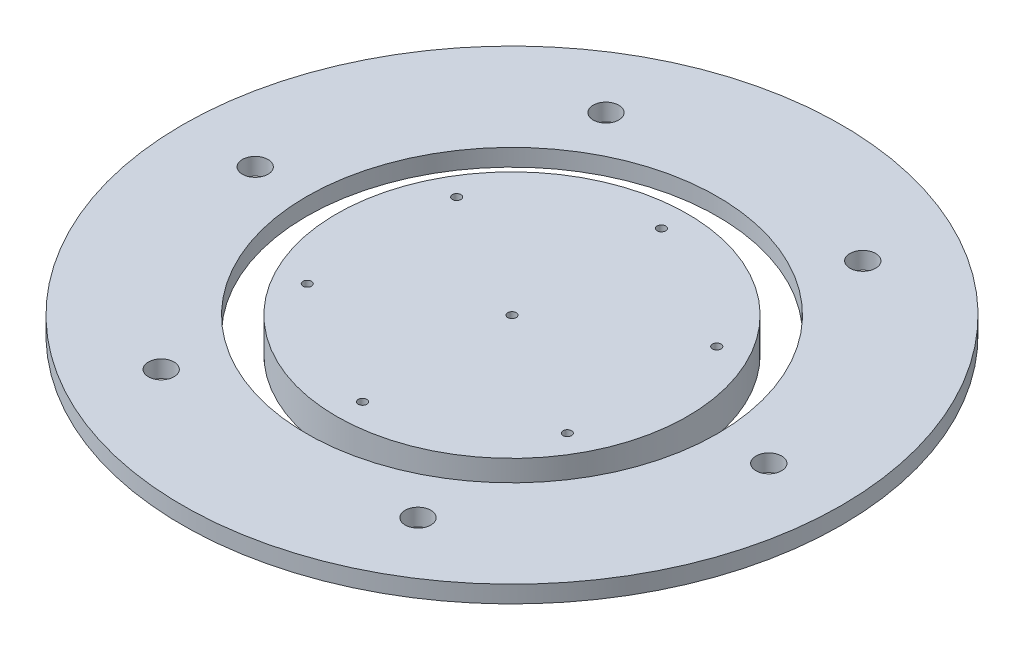
ISO-10303-21;
HEADER;
FILE_DESCRIPTION(('STEP AP214'),'2;1');
FILE_NAME('part.step','',(''),(''),'','','');
FILE_SCHEMA(('AUTOMOTIVE_DESIGN { 1 0 10303 214 1 1 1 1 }'));
ENDSEC;
DATA;
#1=APPLICATION_CONTEXT('core data for automotive mechanical design processes');
#2=APPLICATION_PROTOCOL_DEFINITION('international standard','automotive_design',2000,#1);
#3=PRODUCT_CONTEXT('',#1,'mechanical');
#4=PRODUCT('Part','Part','',(#3));
#5=PRODUCT_RELATED_PRODUCT_CATEGORY('part','',(#4));
#6=PRODUCT_DEFINITION_FORMATION('','',#4);
#7=PRODUCT_DEFINITION_CONTEXT('part definition',#1,'design');
#8=PRODUCT_DEFINITION('design','',#6,#7);
#9=PRODUCT_DEFINITION_SHAPE('','',#8);
#10=(LENGTH_UNIT() NAMED_UNIT(*) SI_UNIT(.MILLI.,.METRE.));
#11=(NAMED_UNIT(*) PLANE_ANGLE_UNIT() SI_UNIT($,.RADIAN.));
#12=(NAMED_UNIT(*) SI_UNIT($,.STERADIAN.) SOLID_ANGLE_UNIT());
#13=UNCERTAINTY_MEASURE_WITH_UNIT(LENGTH_MEASURE(1.E-05),#10,'distance_accuracy_value','');
#14=(GEOMETRIC_REPRESENTATION_CONTEXT(3) GLOBAL_UNCERTAINTY_ASSIGNED_CONTEXT((#13)) GLOBAL_UNIT_ASSIGNED_CONTEXT((#10,
#11,#12)) REPRESENTATION_CONTEXT('',''));
#15=CARTESIAN_POINT('',(0.,0.,0.));
#16=DIRECTION('',(0.,0.,1.));
#17=DIRECTION('',(1.,0.,0.));
#18=AXIS2_PLACEMENT_3D('',#15,#16,#17);
#19=CARTESIAN_POINT('',(-2196.04150385977,-62.2840729070553,1150.50690940037));
#20=DIRECTION('',(0.,1.,1.36522199012273E-12));
#21=DIRECTION('',(0.864792351952172,6.85598171020346E-13,-0.502129652584898));
#22=AXIS2_PLACEMENT_3D('',#19,#20,#21);
#23=PLANE('',#22);
#24=CARTESIAN_POINT('',(-2195.99843882454,-62.2840729070792,1168.0068564118));
#25=DIRECTION('',(0.,1.,1.36522199012273E-12));
#26=DIRECTION('',(0.864792351952172,6.85598171020346E-13,-0.502129652584898));
#27=AXIS2_PLACEMENT_3D('',#24,#25,#26);
#28=CIRCLE('',#27,0.500000000000168);
#29=CARTESIAN_POINT('',(-2195.56604264856,-62.2840729070788,1167.75579158551));
#30=VERTEX_POINT('',#29);
#31=EDGE_CURVE('E80',#30,#30,#28,.T.);
#32=ORIENTED_EDGE('',*,*,#31,.F.);
#33=EDGE_LOOP('',(#32));
#34=FACE_BOUND('',#33,.T.);
#35=CARTESIAN_POINT('',(-2211.21843505416,-62.2840729070434,1141.79423130918));
#36=DIRECTION('',(0.,1.,1.36522199012273E-12));
#37=DIRECTION('',(0.864792351952172,6.85598171020346E-13,-0.502129652584898));
#38=AXIS2_PLACEMENT_3D('',#35,#36,#37);
#39=CIRCLE('',#38,0.500000000002291);
#40=CARTESIAN_POINT('',(-2210.78603887818,-62.284072907043,1141.54316648289));
#41=VERTEX_POINT('',#40);
#42=EDGE_CURVE('E68',#41,#41,#39,.T.);
#43=ORIENTED_EDGE('',*,*,#42,.F.);
#44=EDGE_LOOP('',(#43));
#45=FACE_BOUND('',#44,.T.);
#46=CARTESIAN_POINT('',(-2180.9076377006,-62.2840729070433,1141.71964048014));
#47=DIRECTION('',(0.,1.,1.36522199012273E-12));
#48=DIRECTION('',(0.864792351952172,6.85598171020346E-13,-0.502129652584898));
#49=AXIS2_PLACEMENT_3D('',#46,#47,#48);
#50=CIRCLE('',#49,0.499999999999776);
#51=CARTESIAN_POINT('',(-2180.47524152463,-62.2840729070429,1141.46857565384));
#52=VERTEX_POINT('',#51);
#53=EDGE_CURVE('E56',#52,#52,#50,.T.);
#54=ORIENTED_EDGE('',*,*,#53,.F.);
#55=EDGE_LOOP('',(#54));
#56=FACE_BOUND('',#55,.T.);
#57=CARTESIAN_POINT('',(-2196.04150385977,-62.2840729070553,1150.50690940037));
#58=DIRECTION('',(0.,1.,1.36522199012273E-12));
#59=DIRECTION('',(0.864792351952172,6.85598171020346E-13,-0.502129652584898));
#60=AXIS2_PLACEMENT_3D('',#57,#58,#59);
#61=CIRCLE('',#60,20.5000000000002);
#62=CARTESIAN_POINT('',(-2178.31326064475,-62.2840729070412,1140.21325152238));
#63=VERTEX_POINT('',#62);
#64=EDGE_CURVE('E11',#63,#63,#61,.T.);
#65=ORIENTED_EDGE('',*,*,#64,.T.);
#66=EDGE_LOOP('',(#65));
#67=FACE_BOUND('',#66,.T.);
#68=CARTESIAN_POINT('',(-2196.04150385977,-62.2840729070553,1150.50690940037));
#69=DIRECTION('',(0.,1.,1.36522199012273E-12));
#70=DIRECTION('',(0.864792351952172,6.85598171020346E-13,-0.502129652584898));
#71=AXIS2_PLACEMENT_3D('',#68,#69,#70);
#72=CIRCLE('',#71,0.500000000000167);
#73=CARTESIAN_POINT('',(-2195.60910768379,-62.2840729070549,1150.25584457408));
#74=VERTEX_POINT('',#73);
#75=EDGE_CURVE('E51',#74,#74,#72,.T.);
#76=ORIENTED_EDGE('',*,*,#75,.F.);
#77=EDGE_LOOP('',(#76));
#78=FACE_BOUND('',#77,.T.);
#79=CARTESIAN_POINT('',(-2196.08456889499,-62.2840729070314,1133.00696238895));
#80=DIRECTION('',(0.,1.,1.36522199012273E-12));
#81=DIRECTION('',(0.864792351952172,6.85598171020346E-13,-0.502129652584898));
#82=AXIS2_PLACEMENT_3D('',#79,#80,#81);
#83=CIRCLE('',#82,0.499999999999973);
#84=CARTESIAN_POINT('',(-2195.65217271902,-62.284072907031,1132.75589756265));
#85=VERTEX_POINT('',#84);
#86=EDGE_CURVE('E62',#85,#85,#83,.T.);
#87=ORIENTED_EDGE('',*,*,#86,.F.);
#88=EDGE_LOOP('',(#87));
#89=FACE_BOUND('',#88,.T.);
#90=CARTESIAN_POINT('',(-2211.17537001893,-62.2840729070673,1159.29417832061));
#91=DIRECTION('',(0.,1.,1.36522199012273E-12));
#92=DIRECTION('',(0.864792351952172,6.85598171020346E-13,-0.502129652584898));
#93=AXIS2_PLACEMENT_3D('',#90,#91,#92);
#94=CIRCLE('',#93,0.499999999999776);
#95=CARTESIAN_POINT('',(-2210.74297384295,-62.2840729070669,1159.04311349432));
#96=VERTEX_POINT('',#95);
#97=EDGE_CURVE('E74',#96,#96,#94,.T.);
#98=ORIENTED_EDGE('',*,*,#97,.F.);
#99=EDGE_LOOP('',(#98));
#100=FACE_BOUND('',#99,.T.);
#101=CARTESIAN_POINT('',(-2180.86457266538,-62.2840729070672,1159.21958749156));
#102=DIRECTION('',(0.,1.,1.36522199012273E-12));
#103=DIRECTION('',(0.864792351952172,6.85598171020346E-13,-0.502129652584898));
#104=AXIS2_PLACEMENT_3D('',#101,#102,#103);
#105=CIRCLE('',#104,0.499999999999973);
#106=CARTESIAN_POINT('',(-2180.4321764894,-62.2840729070668,1158.96852266527));
#107=VERTEX_POINT('',#106);
#108=EDGE_CURVE('E86',#107,#107,#105,.T.);
#109=ORIENTED_EDGE('',*,*,#108,.F.);
#110=EDGE_LOOP('',(#109));
#111=FACE_BOUND('',#110,.T.);
#112=ADVANCED_FACE('F40',(#34,#45,#56,#67,#78,#89,#100,#111),#23,.T.);
#113=CARTESIAN_POINT('',(-2196.04150385977,-66.2840729070553,1150.50690940037));
#114=DIRECTION('',(0.,1.,1.36522199012273E-12));
#115=DIRECTION('',(0.864792351952172,6.85598171020346E-13,-0.502129652584898));
#116=AXIS2_PLACEMENT_3D('',#113,#114,#115);
#117=PLANE('',#116);
#118=CARTESIAN_POINT('',(-2195.99843882454,-66.2840729070792,1168.00685641179));
#119=DIRECTION('',(0.,1.,1.36522199012273E-12));
#120=DIRECTION('',(0.864792351952172,6.85598171020346E-13,-0.502129652584898));
#121=AXIS2_PLACEMENT_3D('',#118,#119,#120);
#122=CIRCLE('',#121,0.500000000000168);
#123=CARTESIAN_POINT('',(-2195.56604264856,-66.2840729070788,1167.7557915855));
#124=VERTEX_POINT('',#123);
#125=EDGE_CURVE('E83',#124,#124,#122,.T.);
#126=ORIENTED_EDGE('',*,*,#125,.T.);
#127=EDGE_LOOP('',(#126));
#128=FACE_BOUND('',#127,.T.);
#129=CARTESIAN_POINT('',(-2211.21843505416,-66.2840729070434,1141.79423130918));
#130=DIRECTION('',(0.,1.,1.36522199012273E-12));
#131=DIRECTION('',(0.864792351952172,6.85598171020346E-13,-0.502129652584898));
#132=AXIS2_PLACEMENT_3D('',#129,#130,#131);
#133=CIRCLE('',#132,0.500000000002291);
#134=CARTESIAN_POINT('',(-2210.78603887818,-66.284072907043,1141.54316648288));
#135=VERTEX_POINT('',#134);
#136=EDGE_CURVE('E71',#135,#135,#133,.T.);
#137=ORIENTED_EDGE('',*,*,#136,.T.);
#138=EDGE_LOOP('',(#137));
#139=FACE_BOUND('',#138,.T.);
#140=CARTESIAN_POINT('',(-2180.9076377006,-66.2840729070433,1141.71964048013));
#141=DIRECTION('',(0.,1.,1.36522199012273E-12));
#142=DIRECTION('',(0.864792351952172,6.85598171020346E-13,-0.502129652584898));
#143=AXIS2_PLACEMENT_3D('',#140,#141,#142);
#144=CIRCLE('',#143,0.499999999999776);
#145=CARTESIAN_POINT('',(-2180.47524152463,-66.2840729070429,1141.46857565384));
#146=VERTEX_POINT('',#145);
#147=EDGE_CURVE('E59',#146,#146,#144,.T.);
#148=ORIENTED_EDGE('',*,*,#147,.T.);
#149=EDGE_LOOP('',(#148));
#150=FACE_BOUND('',#149,.T.);
#151=CARTESIAN_POINT('',(-2196.04150385977,-66.2840729070553,1150.50690940037));
#152=DIRECTION('',(0.,1.,1.36522199012273E-12));
#153=DIRECTION('',(0.864792351952172,6.85598171020346E-13,-0.502129652584898));
#154=AXIS2_PLACEMENT_3D('',#151,#152,#153);
#155=CIRCLE('',#154,20.5000000000002);
#156=CARTESIAN_POINT('',(-2178.31326064475,-66.2840729070412,1140.21325152238));
#157=VERTEX_POINT('',#156);
#158=EDGE_CURVE('E44',#157,#157,#155,.T.);
#159=ORIENTED_EDGE('',*,*,#158,.F.);
#160=EDGE_LOOP('',(#159));
#161=FACE_BOUND('',#160,.T.);
#162=CARTESIAN_POINT('',(-2196.04150385977,-66.2840729070553,1150.50690940037));
#163=DIRECTION('',(0.,1.,1.36522199012273E-12));
#164=DIRECTION('',(0.864792351952172,6.85598171020346E-13,-0.502129652584898));
#165=AXIS2_PLACEMENT_3D('',#162,#163,#164);
#166=CIRCLE('',#165,0.500000000000167);
#167=CARTESIAN_POINT('',(-2195.60910768379,-66.2840729070549,1150.25584457407));
#168=VERTEX_POINT('',#167);
#169=EDGE_CURVE('E53',#168,#168,#166,.T.);
#170=ORIENTED_EDGE('',*,*,#169,.T.);
#171=EDGE_LOOP('',(#170));
#172=FACE_BOUND('',#171,.T.);
#173=CARTESIAN_POINT('',(-2196.08456889499,-66.2840729070314,1133.00696238894));
#174=DIRECTION('',(0.,1.,1.36522199012273E-12));
#175=DIRECTION('',(0.864792351952172,6.85598171020346E-13,-0.502129652584898));
#176=AXIS2_PLACEMENT_3D('',#173,#174,#175);
#177=CIRCLE('',#176,0.499999999999973);
#178=CARTESIAN_POINT('',(-2195.65217271902,-66.284072907031,1132.75589756265));
#179=VERTEX_POINT('',#178);
#180=EDGE_CURVE('E65',#179,#179,#177,.T.);
#181=ORIENTED_EDGE('',*,*,#180,.T.);
#182=EDGE_LOOP('',(#181));
#183=FACE_BOUND('',#182,.T.);
#184=CARTESIAN_POINT('',(-2211.17537001893,-66.2840729070673,1159.2941783206));
#185=DIRECTION('',(0.,1.,1.36522199012273E-12));
#186=DIRECTION('',(0.864792351952172,6.85598171020346E-13,-0.502129652584898));
#187=AXIS2_PLACEMENT_3D('',#184,#185,#186);
#188=CIRCLE('',#187,0.499999999999776);
#189=CARTESIAN_POINT('',(-2210.74297384295,-66.2840729070669,1159.04311349431));
#190=VERTEX_POINT('',#189);
#191=EDGE_CURVE('E77',#190,#190,#188,.T.);
#192=ORIENTED_EDGE('',*,*,#191,.T.);
#193=EDGE_LOOP('',(#192));
#194=FACE_BOUND('',#193,.T.);
#195=CARTESIAN_POINT('',(-2180.86457266538,-66.2840729070672,1159.21958749156));
#196=DIRECTION('',(0.,1.,1.36522199012273E-12));
#197=DIRECTION('',(0.864792351952172,6.85598171020346E-13,-0.502129652584898));
#198=AXIS2_PLACEMENT_3D('',#195,#196,#197);
#199=CIRCLE('',#198,0.499999999999973);
#200=CARTESIAN_POINT('',(-2180.4321764894,-66.2840729070668,1158.96852266527));
#201=VERTEX_POINT('',#200);
#202=EDGE_CURVE('E89',#201,#201,#199,.T.);
#203=ORIENTED_EDGE('',*,*,#202,.T.);
#204=EDGE_LOOP('',(#203));
#205=FACE_BOUND('',#204,.T.);
#206=ADVANCED_FACE('F99',(#128,#139,#150,#161,#172,#183,#194,#205),#117,.F.);
#207=CARTESIAN_POINT('',(-2196.04150385977,-62.2840729070553,1150.50690940037));
#208=DIRECTION('',(0.,-1.,-1.36522199012273E-12));
#209=DIRECTION('',(-0.864792351952172,-6.85598171020346E-13,0.502129652584898));
#210=AXIS2_PLACEMENT_3D('',#207,#208,#209);
#211=CYLINDRICAL_SURFACE('',#210,20.5000000000002);
#212=ORIENTED_EDGE('',*,*,#64,.F.);
#213=EDGE_LOOP('',(#212));
#214=FACE_BOUND('',#213,.T.);
#215=ORIENTED_EDGE('',*,*,#158,.T.);
#216=EDGE_LOOP('',(#215));
#217=FACE_BOUND('',#216,.T.);
#218=ADVANCED_FACE('F42',(#214,#217),#211,.T.);
#219=CARTESIAN_POINT('',(-2196.04150385977,-62.2840729070553,1150.50690940037));
#220=DIRECTION('',(0.,-1.,-1.36522199012273E-12));
#221=DIRECTION('',(-0.864792351952172,-6.85598171020346E-13,0.502129652584898));
#222=AXIS2_PLACEMENT_3D('',#219,#220,#221);
#223=CYLINDRICAL_SURFACE('',#222,0.500000000000167);
#224=ORIENTED_EDGE('',*,*,#75,.T.);
#225=EDGE_LOOP('',(#224));
#226=FACE_BOUND('',#225,.T.);
#227=ORIENTED_EDGE('',*,*,#169,.F.);
#228=EDGE_LOOP('',(#227));
#229=FACE_BOUND('',#228,.T.);
#230=ADVANCED_FACE('F109',(#226,#229),#223,.F.);
#231=CARTESIAN_POINT('',(-2180.9076377006,-62.2840729070433,1141.71964048014));
#232=DIRECTION('',(0.,-1.,-1.36522199012273E-12));
#233=DIRECTION('',(-0.864792351952172,-6.85598171020346E-13,0.502129652584898));
#234=AXIS2_PLACEMENT_3D('',#231,#232,#233);
#235=CYLINDRICAL_SURFACE('',#234,0.499999999999776);
#236=ORIENTED_EDGE('',*,*,#53,.T.);
#237=EDGE_LOOP('',(#236));
#238=FACE_BOUND('',#237,.T.);
#239=ORIENTED_EDGE('',*,*,#147,.F.);
#240=EDGE_LOOP('',(#239));
#241=FACE_BOUND('',#240,.T.);
#242=ADVANCED_FACE('F112',(#238,#241),#235,.F.);
#243=CARTESIAN_POINT('',(-2196.08456889499,-62.2840729070314,1133.00696238895));
#244=DIRECTION('',(0.,-1.,-1.36522199012273E-12));
#245=DIRECTION('',(-0.864792351952172,-6.85598171020346E-13,0.502129652584898));
#246=AXIS2_PLACEMENT_3D('',#243,#244,#245);
#247=CYLINDRICAL_SURFACE('',#246,0.499999999999973);
#248=ORIENTED_EDGE('',*,*,#86,.T.);
#249=EDGE_LOOP('',(#248));
#250=FACE_BOUND('',#249,.T.);
#251=ORIENTED_EDGE('',*,*,#180,.F.);
#252=EDGE_LOOP('',(#251));
#253=FACE_BOUND('',#252,.T.);
#254=ADVANCED_FACE('F116',(#250,#253),#247,.F.);
#255=CARTESIAN_POINT('',(-2211.21843505416,-62.2840729070434,1141.79423130918));
#256=DIRECTION('',(0.,-1.,-1.36522199012273E-12));
#257=DIRECTION('',(-0.864792351952172,-6.85598171020346E-13,0.502129652584898));
#258=AXIS2_PLACEMENT_3D('',#255,#256,#257);
#259=CYLINDRICAL_SURFACE('',#258,0.500000000002291);
#260=ORIENTED_EDGE('',*,*,#42,.T.);
#261=EDGE_LOOP('',(#260));
#262=FACE_BOUND('',#261,.T.);
#263=ORIENTED_EDGE('',*,*,#136,.F.);
#264=EDGE_LOOP('',(#263));
#265=FACE_BOUND('',#264,.T.);
#266=ADVANCED_FACE('F120',(#262,#265),#259,.F.);
#267=CARTESIAN_POINT('',(-2211.17537001893,-62.2840729070673,1159.29417832061));
#268=DIRECTION('',(0.,-1.,-1.36522199012273E-12));
#269=DIRECTION('',(-0.864792351952172,-6.85598171020346E-13,0.502129652584898));
#270=AXIS2_PLACEMENT_3D('',#267,#268,#269);
#271=CYLINDRICAL_SURFACE('',#270,0.499999999999776);
#272=ORIENTED_EDGE('',*,*,#97,.T.);
#273=EDGE_LOOP('',(#272));
#274=FACE_BOUND('',#273,.T.);
#275=ORIENTED_EDGE('',*,*,#191,.F.);
#276=EDGE_LOOP('',(#275));
#277=FACE_BOUND('',#276,.T.);
#278=ADVANCED_FACE('F124',(#274,#277),#271,.F.);
#279=CARTESIAN_POINT('',(-2195.99843882454,-62.2840729070792,1168.0068564118));
#280=DIRECTION('',(0.,-1.,-1.36522199012273E-12));
#281=DIRECTION('',(-0.864792351952172,-6.85598171020346E-13,0.502129652584898));
#282=AXIS2_PLACEMENT_3D('',#279,#280,#281);
#283=CYLINDRICAL_SURFACE('',#282,0.500000000000168);
#284=ORIENTED_EDGE('',*,*,#31,.T.);
#285=EDGE_LOOP('',(#284));
#286=FACE_BOUND('',#285,.T.);
#287=ORIENTED_EDGE('',*,*,#125,.F.);
#288=EDGE_LOOP('',(#287));
#289=FACE_BOUND('',#288,.T.);
#290=ADVANCED_FACE('F128',(#286,#289),#283,.F.);
#291=CARTESIAN_POINT('',(-2180.86457266538,-62.2840729070672,1159.21958749156));
#292=DIRECTION('',(0.,-1.,-1.36522199012273E-12));
#293=DIRECTION('',(-0.864792351952172,-6.85598171020346E-13,0.502129652584898));
#294=AXIS2_PLACEMENT_3D('',#291,#292,#293);
#295=CYLINDRICAL_SURFACE('',#294,0.499999999999973);
#296=ORIENTED_EDGE('',*,*,#108,.T.);
#297=EDGE_LOOP('',(#296));
#298=FACE_BOUND('',#297,.T.);
#299=ORIENTED_EDGE('',*,*,#202,.F.);
#300=EDGE_LOOP('',(#299));
#301=FACE_BOUND('',#300,.T.);
#302=ADVANCED_FACE('F95',(#298,#301),#295,.F.);
#303=CLOSED_SHELL('',(#112,#206,#218,#230,#242,#254,#266,#278,#290,#302));
#304=MANIFOLD_SOLID_BREP('B2',#303);
#305=CARTESIAN_POINT('',(-2196.04150385957,-64.2840729070553,1150.50690940074));
#306=DIRECTION('',(0.,-1.,-1.36500987507499E-12));
#307=DIRECTION('',(1.,0.,-1.783018177548E-13));
#308=AXIS2_PLACEMENT_3D('',#305,#306,#307);
#309=PLANE('',#308);
#310=CARTESIAN_POINT('',(-2166.04150385957,-64.2840729070553,1150.50690940074));
#311=DIRECTION('',(0.,-1.,-1.36500987507499E-12));
#312=DIRECTION('',(1.,0.,-1.783018177548E-13));
#313=AXIS2_PLACEMENT_3D('',#310,#311,#312);
#314=CIRCLE('',#313,1.50000000000006);
#315=CARTESIAN_POINT('',(-2164.54150385957,-64.2840729070553,1150.50690940074));
#316=VERTEX_POINT('',#315);
#317=EDGE_CURVE('E267',#316,#316,#314,.T.);
#318=ORIENTED_EDGE('',*,*,#317,.F.);
#319=EDGE_LOOP('',(#318));
#320=FACE_BOUND('',#319,.T.);
#321=CARTESIAN_POINT('',(-2211.04150385956,-64.2840729070908,1176.48767151428));
#322=DIRECTION('',(0.,-1.,-1.36500987507499E-12));
#323=DIRECTION('',(1.,0.,-1.783018177548E-13));
#324=AXIS2_PLACEMENT_3D('',#321,#322,#323);
#325=CIRCLE('',#324,1.49999999999496);
#326=CARTESIAN_POINT('',(-2209.54150385957,-64.2840729070908,1176.48767151428));
#327=VERTEX_POINT('',#326);
#328=EDGE_CURVE('E255',#327,#327,#325,.T.);
#329=ORIENTED_EDGE('',*,*,#328,.F.);
#330=EDGE_LOOP('',(#329));
#331=FACE_BOUND('',#330,.T.);
#332=CARTESIAN_POINT('',(-2211.04150385957,-64.2840729070198,1124.52614728721));
#333=DIRECTION('',(0.,-1.,-1.36500987507499E-12));
#334=DIRECTION('',(1.,0.,-1.783018177548E-13));
#335=AXIS2_PLACEMENT_3D('',#332,#333,#334);
#336=CIRCLE('',#335,1.50000000000006);
#337=CARTESIAN_POINT('',(-2209.54150385957,-64.2840729070198,1124.52614728721));
#338=VERTEX_POINT('',#337);
#339=EDGE_CURVE('E243',#338,#338,#336,.T.);
#340=ORIENTED_EDGE('',*,*,#339,.F.);
#341=EDGE_LOOP('',(#340));
#342=FACE_BOUND('',#341,.T.);
#343=CARTESIAN_POINT('',(-2196.04150385957,-64.2840729070553,1150.50690940074));
#344=DIRECTION('',(0.,-1.,-1.36500987507499E-12));
#345=DIRECTION('',(1.,0.,-1.783018177548E-13));
#346=AXIS2_PLACEMENT_3D('',#343,#344,#345);
#347=CIRCLE('',#346,38.5);
#348=CARTESIAN_POINT('',(-2157.54150385957,-64.2840729070553,1150.50690940074));
#349=VERTEX_POINT('',#348);
#350=EDGE_CURVE('E39',#349,#349,#347,.T.);
#351=ORIENTED_EDGE('',*,*,#350,.T.);
#352=EDGE_LOOP('',(#351));
#353=FACE_BOUND('',#352,.T.);
#354=CARTESIAN_POINT('',(-2226.04150385957,-64.2840729070553,1150.50690940075));
#355=DIRECTION('',(0.,-1.,-1.36500987507499E-12));
#356=DIRECTION('',(1.,0.,-1.783018177548E-13));
#357=AXIS2_PLACEMENT_3D('',#354,#355,#356);
#358=CIRCLE('',#357,1.50000000000006);
#359=CARTESIAN_POINT('',(-2224.54150385957,-64.2840729070553,1150.50690940075));
#360=VERTEX_POINT('',#359);
#361=EDGE_CURVE('E238',#360,#360,#358,.T.);
#362=ORIENTED_EDGE('',*,*,#361,.F.);
#363=EDGE_LOOP('',(#362));
#364=FACE_BOUND('',#363,.T.);
#365=CARTESIAN_POINT('',(-2181.04150385957,-64.2840729070908,1176.48767151427));
#366=DIRECTION('',(0.,-1.,-1.36500987507499E-12));
#367=DIRECTION('',(1.,0.,-1.783018177548E-13));
#368=AXIS2_PLACEMENT_3D('',#365,#366,#367);
#369=CIRCLE('',#368,1.49999999999659);
#370=CARTESIAN_POINT('',(-2179.54150385957,-64.2840729070908,1176.48767151427));
#371=VERTEX_POINT('',#370);
#372=EDGE_CURVE('E249',#371,#371,#369,.T.);
#373=ORIENTED_EDGE('',*,*,#372,.F.);
#374=EDGE_LOOP('',(#373));
#375=FACE_BOUND('',#374,.T.);
#376=CARTESIAN_POINT('',(-2181.04150385958,-64.2840729070198,1124.5261472872));
#377=DIRECTION('',(0.,-1.,-1.36500987507499E-12));
#378=DIRECTION('',(1.,0.,-1.783018177548E-13));
#379=AXIS2_PLACEMENT_3D('',#376,#377,#378);
#380=CIRCLE('',#379,1.50000000000097);
#381=CARTESIAN_POINT('',(-2179.54150385958,-64.2840729070198,1124.5261472872));
#382=VERTEX_POINT('',#381);
#383=EDGE_CURVE('E261',#382,#382,#380,.T.);
#384=ORIENTED_EDGE('',*,*,#383,.F.);
#385=EDGE_LOOP('',(#384));
#386=FACE_BOUND('',#385,.T.);
#387=CARTESIAN_POINT('',(-2196.04150385957,-64.2840729070553,1150.50690940074));
#388=DIRECTION('',(0.,-1.,-1.36500987507499E-12));
#389=DIRECTION('',(1.,0.,-1.783018177548E-13));
#390=AXIS2_PLACEMENT_3D('',#387,#388,#389);
#391=CIRCLE('',#390,24.);
#392=CARTESIAN_POINT('',(-2172.04150385957,-64.2840729070553,1150.50690940074));
#393=VERTEX_POINT('',#392);
#394=EDGE_CURVE('E273',#393,#393,#391,.T.);
#395=ORIENTED_EDGE('',*,*,#394,.F.);
#396=EDGE_LOOP('',(#395));
#397=FACE_BOUND('',#396,.T.);
#398=ADVANCED_FACE('F227',(#320,#331,#342,#353,#364,#375,#386,#397),#309,.T.);
#399=CARTESIAN_POINT('',(-2196.04150385957,-62.2840729070553,1150.50690940075));
#400=DIRECTION('',(0.,-1.,-1.36500987507499E-12));
#401=DIRECTION('',(1.,0.,-1.783018177548E-13));
#402=AXIS2_PLACEMENT_3D('',#399,#400,#401);
#403=PLANE('',#402);
#404=CARTESIAN_POINT('',(-2166.04150385957,-62.2840729070553,1150.50690940074));
#405=DIRECTION('',(0.,-1.,-1.36500987507499E-12));
#406=DIRECTION('',(1.,0.,-1.783018177548E-13));
#407=AXIS2_PLACEMENT_3D('',#404,#405,#406);
#408=CIRCLE('',#407,1.50000000000006);
#409=CARTESIAN_POINT('',(-2164.54150385957,-62.2840729070553,1150.50690940074));
#410=VERTEX_POINT('',#409);
#411=EDGE_CURVE('E270',#410,#410,#408,.T.);
#412=ORIENTED_EDGE('',*,*,#411,.T.);
#413=EDGE_LOOP('',(#412));
#414=FACE_BOUND('',#413,.T.);
#415=CARTESIAN_POINT('',(-2211.04150385956,-62.2840729070908,1176.48767151428));
#416=DIRECTION('',(0.,-1.,-1.36500987507499E-12));
#417=DIRECTION('',(1.,0.,-1.783018177548E-13));
#418=AXIS2_PLACEMENT_3D('',#415,#416,#417);
#419=CIRCLE('',#418,1.49999999999496);
#420=CARTESIAN_POINT('',(-2209.54150385957,-62.2840729070908,1176.48767151428));
#421=VERTEX_POINT('',#420);
#422=EDGE_CURVE('E258',#421,#421,#419,.T.);
#423=ORIENTED_EDGE('',*,*,#422,.T.);
#424=EDGE_LOOP('',(#423));
#425=FACE_BOUND('',#424,.T.);
#426=CARTESIAN_POINT('',(-2211.04150385957,-62.2840729070198,1124.52614728721));
#427=DIRECTION('',(0.,-1.,-1.36500987507499E-12));
#428=DIRECTION('',(1.,0.,-1.783018177548E-13));
#429=AXIS2_PLACEMENT_3D('',#426,#427,#428);
#430=CIRCLE('',#429,1.50000000000006);
#431=CARTESIAN_POINT('',(-2209.54150385957,-62.2840729070198,1124.52614728721));
#432=VERTEX_POINT('',#431);
#433=EDGE_CURVE('E246',#432,#432,#430,.T.);
#434=ORIENTED_EDGE('',*,*,#433,.T.);
#435=EDGE_LOOP('',(#434));
#436=FACE_BOUND('',#435,.T.);
#437=CARTESIAN_POINT('',(-2196.04150385957,-62.2840729070553,1150.50690940075));
#438=DIRECTION('',(0.,-1.,-1.36500987507499E-12));
#439=DIRECTION('',(1.,0.,-1.783018177548E-13));
#440=AXIS2_PLACEMENT_3D('',#437,#438,#439);
#441=CIRCLE('',#440,38.5);
#442=CARTESIAN_POINT('',(-2157.54150385957,-62.2840729070553,1150.50690940074));
#443=VERTEX_POINT('',#442);
#444=EDGE_CURVE('E231',#443,#443,#441,.T.);
#445=ORIENTED_EDGE('',*,*,#444,.F.);
#446=EDGE_LOOP('',(#445));
#447=FACE_BOUND('',#446,.T.);
#448=CARTESIAN_POINT('',(-2226.04150385957,-62.2840729070553,1150.50690940075));
#449=DIRECTION('',(0.,-1.,-1.36500987507499E-12));
#450=DIRECTION('',(1.,0.,-1.783018177548E-13));
#451=AXIS2_PLACEMENT_3D('',#448,#449,#450);
#452=CIRCLE('',#451,1.50000000000006);
#453=CARTESIAN_POINT('',(-2224.54150385957,-62.2840729070553,1150.50690940075));
#454=VERTEX_POINT('',#453);
#455=EDGE_CURVE('E240',#454,#454,#452,.T.);
#456=ORIENTED_EDGE('',*,*,#455,.T.);
#457=EDGE_LOOP('',(#456));
#458=FACE_BOUND('',#457,.T.);
#459=CARTESIAN_POINT('',(-2181.04150385957,-62.2840729070908,1176.48767151428));
#460=DIRECTION('',(0.,-1.,-1.36500987507499E-12));
#461=DIRECTION('',(1.,0.,-1.783018177548E-13));
#462=AXIS2_PLACEMENT_3D('',#459,#460,#461);
#463=CIRCLE('',#462,1.49999999999659);
#464=CARTESIAN_POINT('',(-2179.54150385957,-62.2840729070908,1176.48767151428));
#465=VERTEX_POINT('',#464);
#466=EDGE_CURVE('E252',#465,#465,#463,.T.);
#467=ORIENTED_EDGE('',*,*,#466,.T.);
#468=EDGE_LOOP('',(#467));
#469=FACE_BOUND('',#468,.T.);
#470=CARTESIAN_POINT('',(-2181.04150385958,-62.2840729070198,1124.52614728721));
#471=DIRECTION('',(0.,-1.,-1.36500987507499E-12));
#472=DIRECTION('',(1.,0.,-1.783018177548E-13));
#473=AXIS2_PLACEMENT_3D('',#470,#471,#472);
#474=CIRCLE('',#473,1.50000000000097);
#475=CARTESIAN_POINT('',(-2179.54150385958,-62.2840729070198,1124.52614728721));
#476=VERTEX_POINT('',#475);
#477=EDGE_CURVE('E264',#476,#476,#474,.T.);
#478=ORIENTED_EDGE('',*,*,#477,.T.);
#479=EDGE_LOOP('',(#478));
#480=FACE_BOUND('',#479,.T.);
#481=CARTESIAN_POINT('',(-2196.04150385957,-62.2840729070553,1150.50690940075));
#482=DIRECTION('',(0.,-1.,-1.36500987507499E-12));
#483=DIRECTION('',(1.,0.,-1.783018177548E-13));
#484=AXIS2_PLACEMENT_3D('',#481,#482,#483);
#485=CIRCLE('',#484,24.);
#486=CARTESIAN_POINT('',(-2172.04150385957,-62.2840729070553,1150.50690940074));
#487=VERTEX_POINT('',#486);
#488=EDGE_CURVE('E276',#487,#487,#485,.T.);
#489=ORIENTED_EDGE('',*,*,#488,.T.);
#490=EDGE_LOOP('',(#489));
#491=FACE_BOUND('',#490,.T.);
#492=ADVANCED_FACE('F286',(#414,#425,#436,#447,#458,#469,#480,#491),#403,.F.);
#493=CARTESIAN_POINT('',(-2196.04150385957,-64.2840729070553,1150.50690940074));
#494=DIRECTION('',(0.,1.,1.36500987507499E-12));
#495=DIRECTION('',(-1.,0.,1.783018177548E-13));
#496=AXIS2_PLACEMENT_3D('',#493,#494,#495);
#497=CYLINDRICAL_SURFACE('',#496,38.5);
#498=ORIENTED_EDGE('',*,*,#350,.F.);
#499=EDGE_LOOP('',(#498));
#500=FACE_BOUND('',#499,.T.);
#501=ORIENTED_EDGE('',*,*,#444,.T.);
#502=EDGE_LOOP('',(#501));
#503=FACE_BOUND('',#502,.T.);
#504=ADVANCED_FACE('F229',(#500,#503),#497,.T.);
#505=CARTESIAN_POINT('',(-2226.04150385957,-64.2840729070553,1150.50690940075));
#506=DIRECTION('',(0.,1.,1.36500987507499E-12));
#507=DIRECTION('',(-1.,0.,1.783018177548E-13));
#508=AXIS2_PLACEMENT_3D('',#505,#506,#507);
#509=CYLINDRICAL_SURFACE('',#508,1.50000000000006);
#510=ORIENTED_EDGE('',*,*,#361,.T.);
#511=EDGE_LOOP('',(#510));
#512=FACE_BOUND('',#511,.T.);
#513=ORIENTED_EDGE('',*,*,#455,.F.);
#514=EDGE_LOOP('',(#513));
#515=FACE_BOUND('',#514,.T.);
#516=ADVANCED_FACE('F296',(#512,#515),#509,.F.);
#517=CARTESIAN_POINT('',(-2211.04150385957,-64.2840729070198,1124.52614728721));
#518=DIRECTION('',(0.,1.,1.36500987507499E-12));
#519=DIRECTION('',(-1.,0.,1.783018177548E-13));
#520=AXIS2_PLACEMENT_3D('',#517,#518,#519);
#521=CYLINDRICAL_SURFACE('',#520,1.50000000000006);
#522=ORIENTED_EDGE('',*,*,#339,.T.);
#523=EDGE_LOOP('',(#522));
#524=FACE_BOUND('',#523,.T.);
#525=ORIENTED_EDGE('',*,*,#433,.F.);
#526=EDGE_LOOP('',(#525));
#527=FACE_BOUND('',#526,.T.);
#528=ADVANCED_FACE('F299',(#524,#527),#521,.F.);
#529=CARTESIAN_POINT('',(-2181.04150385957,-64.2840729070908,1176.48767151427));
#530=DIRECTION('',(0.,1.,1.36500987507499E-12));
#531=DIRECTION('',(-1.,0.,1.783018177548E-13));
#532=AXIS2_PLACEMENT_3D('',#529,#530,#531);
#533=CYLINDRICAL_SURFACE('',#532,1.49999999999659);
#534=ORIENTED_EDGE('',*,*,#372,.T.);
#535=EDGE_LOOP('',(#534));
#536=FACE_BOUND('',#535,.T.);
#537=ORIENTED_EDGE('',*,*,#466,.F.);
#538=EDGE_LOOP('',(#537));
#539=FACE_BOUND('',#538,.T.);
#540=ADVANCED_FACE('F303',(#536,#539),#533,.F.);
#541=CARTESIAN_POINT('',(-2211.04150385956,-64.2840729070908,1176.48767151428));
#542=DIRECTION('',(0.,1.,1.36500987507499E-12));
#543=DIRECTION('',(-1.,0.,1.783018177548E-13));
#544=AXIS2_PLACEMENT_3D('',#541,#542,#543);
#545=CYLINDRICAL_SURFACE('',#544,1.49999999999496);
#546=ORIENTED_EDGE('',*,*,#328,.T.);
#547=EDGE_LOOP('',(#546));
#548=FACE_BOUND('',#547,.T.);
#549=ORIENTED_EDGE('',*,*,#422,.F.);
#550=EDGE_LOOP('',(#549));
#551=FACE_BOUND('',#550,.T.);
#552=ADVANCED_FACE('F307',(#548,#551),#545,.F.);
#553=CARTESIAN_POINT('',(-2181.04150385958,-64.2840729070198,1124.5261472872));
#554=DIRECTION('',(0.,1.,1.36500987507499E-12));
#555=DIRECTION('',(-1.,0.,1.783018177548E-13));
#556=AXIS2_PLACEMENT_3D('',#553,#554,#555);
#557=CYLINDRICAL_SURFACE('',#556,1.50000000000097);
#558=ORIENTED_EDGE('',*,*,#383,.T.);
#559=EDGE_LOOP('',(#558));
#560=FACE_BOUND('',#559,.T.);
#561=ORIENTED_EDGE('',*,*,#477,.F.);
#562=EDGE_LOOP('',(#561));
#563=FACE_BOUND('',#562,.T.);
#564=ADVANCED_FACE('F311',(#560,#563),#557,.F.);
#565=CARTESIAN_POINT('',(-2166.04150385957,-64.2840729070553,1150.50690940074));
#566=DIRECTION('',(0.,1.,1.36500987507499E-12));
#567=DIRECTION('',(-1.,0.,1.783018177548E-13));
#568=AXIS2_PLACEMENT_3D('',#565,#566,#567);
#569=CYLINDRICAL_SURFACE('',#568,1.50000000000006);
#570=ORIENTED_EDGE('',*,*,#317,.T.);
#571=EDGE_LOOP('',(#570));
#572=FACE_BOUND('',#571,.T.);
#573=ORIENTED_EDGE('',*,*,#411,.F.);
#574=EDGE_LOOP('',(#573));
#575=FACE_BOUND('',#574,.T.);
#576=ADVANCED_FACE('F315',(#572,#575),#569,.F.);
#577=CARTESIAN_POINT('',(-2196.04150385957,-64.2840729070553,1150.50690940074));
#578=DIRECTION('',(0.,1.,1.36500987507499E-12));
#579=DIRECTION('',(-1.,0.,1.783018177548E-13));
#580=AXIS2_PLACEMENT_3D('',#577,#578,#579);
#581=CYLINDRICAL_SURFACE('',#580,24.);
#582=ORIENTED_EDGE('',*,*,#394,.T.);
#583=EDGE_LOOP('',(#582));
#584=FACE_BOUND('',#583,.T.);
#585=ORIENTED_EDGE('',*,*,#488,.F.);
#586=EDGE_LOOP('',(#585));
#587=FACE_BOUND('',#586,.T.);
#588=ADVANCED_FACE('F282',(#584,#587),#581,.F.);
#589=CLOSED_SHELL('',(#398,#492,#504,#516,#528,#540,#552,#564,#576,#588));
#590=MANIFOLD_SOLID_BREP('B6',#589);
#591=ADVANCED_BREP_SHAPE_REPRESENTATION('',(#18,#304,#590),#14);
#592=SHAPE_DEFINITION_REPRESENTATION(#9,#591);
ENDSEC;
END-ISO-10303-21;
